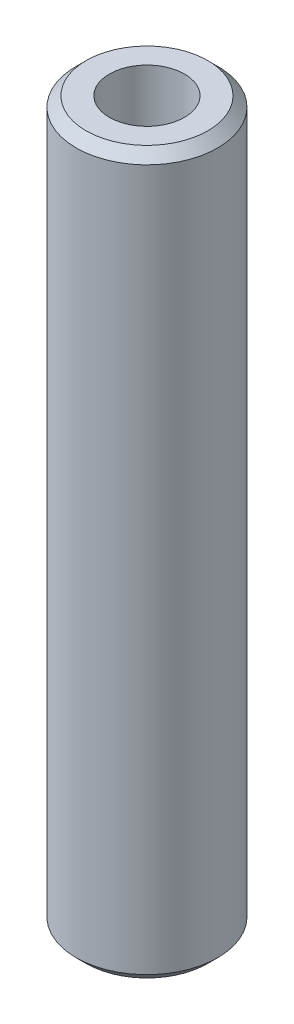
ISO-10303-21;
HEADER;
FILE_DESCRIPTION(('STEP AP214'),'2;1');
FILE_NAME('part.step','',(''),(''),'','','');
FILE_SCHEMA(('AUTOMOTIVE_DESIGN { 1 0 10303 214 1 1 1 1 }'));
ENDSEC;
DATA;
#1=APPLICATION_CONTEXT('core data for automotive mechanical design processes');
#2=APPLICATION_PROTOCOL_DEFINITION('international standard','automotive_design',2000,#1);
#3=PRODUCT_CONTEXT('',#1,'mechanical');
#4=PRODUCT('Part','Part','',(#3));
#5=PRODUCT_RELATED_PRODUCT_CATEGORY('part','',(#4));
#6=PRODUCT_DEFINITION_FORMATION('','',#4);
#7=PRODUCT_DEFINITION_CONTEXT('part definition',#1,'design');
#8=PRODUCT_DEFINITION('design','',#6,#7);
#9=PRODUCT_DEFINITION_SHAPE('','',#8);
#10=(LENGTH_UNIT() NAMED_UNIT(*) SI_UNIT(.MILLI.,.METRE.));
#11=(NAMED_UNIT(*) PLANE_ANGLE_UNIT() SI_UNIT($,.RADIAN.));
#12=(NAMED_UNIT(*) SI_UNIT($,.STERADIAN.) SOLID_ANGLE_UNIT());
#13=UNCERTAINTY_MEASURE_WITH_UNIT(LENGTH_MEASURE(1.E-05),#10,'distance_accuracy_value','');
#14=(GEOMETRIC_REPRESENTATION_CONTEXT(3) GLOBAL_UNCERTAINTY_ASSIGNED_CONTEXT((#13)) GLOBAL_UNIT_ASSIGNED_CONTEXT((#10,
#11,#12)) REPRESENTATION_CONTEXT('',''));
#15=CARTESIAN_POINT('',(0.,0.,0.));
#16=DIRECTION('',(0.,0.,1.));
#17=DIRECTION('',(1.,0.,0.));
#18=AXIS2_PLACEMENT_3D('',#15,#16,#17);
#19=CARTESIAN_POINT('',(0.,178.356466410994,0.));
#20=DIRECTION('',(0.,-1.,0.));
#21=DIRECTION('',(0.,0.,-1.));
#22=AXIS2_PLACEMENT_3D('',#19,#20,#21);
#23=CYLINDRICAL_SURFACE('',#22,17.5);
#24=CARTESIAN_POINT('',(0.,175.909775567955,0.));
#25=DIRECTION('',(0.,1.,0.));
#26=DIRECTION('',(0.,0.,1.));
#27=AXIS2_PLACEMENT_3D('',#24,#25,#26);
#28=CIRCLE('',#27,17.5);
#29=CARTESIAN_POINT('',(0.,175.909775567955,17.5));
#30=VERTEX_POINT('',#29);
#31=EDGE_CURVE('E50',#30,#30,#28,.F.);
#32=ORIENTED_EDGE('',*,*,#31,.T.);
#33=EDGE_LOOP('',(#32));
#34=FACE_BOUND('',#33,.T.);
#35=CARTESIAN_POINT('',(0.,2.44669084303856,0.));
#36=DIRECTION('',(0.,1.,0.));
#37=DIRECTION('',(0.,0.,1.));
#38=AXIS2_PLACEMENT_3D('',#35,#36,#37);
#39=CIRCLE('',#38,17.5);
#40=CARTESIAN_POINT('',(0.,2.44669084303856,17.5));
#41=VERTEX_POINT('',#40);
#42=EDGE_CURVE('E51',#41,#41,#39,.T.);
#43=ORIENTED_EDGE('',*,*,#42,.T.);
#44=EDGE_LOOP('',(#43));
#45=FACE_BOUND('',#44,.T.);
#46=ADVANCED_FACE('F39',(#34,#45),#23,.T.);
#47=CARTESIAN_POINT('',(0.,178.356466410994,0.));
#48=DIRECTION('',(0.,1.,0.));
#49=DIRECTION('',(0.,0.,1.));
#50=AXIS2_PLACEMENT_3D('',#47,#48,#49);
#51=PLANE('',#50);
#52=CARTESIAN_POINT('',(0.,178.356466410994,0.));
#53=DIRECTION('',(0.,1.,0.));
#54=DIRECTION('',(0.,0.,1.));
#55=AXIS2_PLACEMENT_3D('',#52,#53,#54);
#56=CIRCLE('',#55,15.0533091569614);
#57=CARTESIAN_POINT('',(0.,178.356466410994,15.0533091569614));
#58=VERTEX_POINT('',#57);
#59=EDGE_CURVE('E54',#58,#58,#56,.T.);
#60=ORIENTED_EDGE('',*,*,#59,.T.);
#61=EDGE_LOOP('',(#60));
#62=FACE_BOUND('',#61,.T.);
#63=CARTESIAN_POINT('',(0.,178.356466410994,0.));
#64=DIRECTION('',(0.,1.,0.));
#65=DIRECTION('',(0.,0.,1.));
#66=AXIS2_PLACEMENT_3D('',#63,#64,#65);
#67=CIRCLE('',#66,9.29110883038514);
#68=CARTESIAN_POINT('',(0.,178.356466410994,9.29110883038514));
#69=VERTEX_POINT('',#68);
#70=EDGE_CURVE('E58',#69,#69,#67,.T.);
#71=ORIENTED_EDGE('',*,*,#70,.F.);
#72=EDGE_LOOP('',(#71));
#73=FACE_BOUND('',#72,.T.);
#74=ADVANCED_FACE('F69',(#62,#73),#51,.T.);
#75=CARTESIAN_POINT('',(0.,0.,0.));
#76=DIRECTION('',(0.,1.,0.));
#77=DIRECTION('',(0.,0.,1.));
#78=AXIS2_PLACEMENT_3D('',#75,#76,#77);
#79=PLANE('',#78);
#80=CARTESIAN_POINT('',(0.,0.,0.));
#81=DIRECTION('',(0.,1.,0.));
#82=DIRECTION('',(0.,0.,1.));
#83=AXIS2_PLACEMENT_3D('',#80,#81,#82);
#84=CIRCLE('',#83,15.0533091569614);
#85=CARTESIAN_POINT('',(0.,0.,15.0533091569614));
#86=VERTEX_POINT('',#85);
#87=EDGE_CURVE('E10',#86,#86,#84,.F.);
#88=ORIENTED_EDGE('',*,*,#87,.T.);
#89=EDGE_LOOP('',(#88));
#90=FACE_BOUND('',#89,.T.);
#91=CARTESIAN_POINT('',(0.,0.,0.));
#92=DIRECTION('',(0.,1.,0.));
#93=DIRECTION('',(0.,0.,1.));
#94=AXIS2_PLACEMENT_3D('',#91,#92,#93);
#95=CIRCLE('',#94,9.29110883038514);
#96=CARTESIAN_POINT('',(0.,0.,9.29110883038514));
#97=VERTEX_POINT('',#96);
#98=EDGE_CURVE('E63',#97,#97,#95,.T.);
#99=ORIENTED_EDGE('',*,*,#98,.T.);
#100=EDGE_LOOP('',(#99));
#101=FACE_BOUND('',#100,.T.);
#102=ADVANCED_FACE('F75',(#90,#101),#79,.F.);
#103=CARTESIAN_POINT('',(0.,178.356466410994,0.));
#104=DIRECTION('',(0.,-1.,0.));
#105=DIRECTION('',(0.,0.,-1.));
#106=AXIS2_PLACEMENT_3D('',#103,#104,#105);
#107=CYLINDRICAL_SURFACE('',#106,9.29110883038514);
#108=ORIENTED_EDGE('',*,*,#70,.T.);
#109=EDGE_LOOP('',(#108));
#110=FACE_BOUND('',#109,.T.);
#111=ORIENTED_EDGE('',*,*,#98,.F.);
#112=EDGE_LOOP('',(#111));
#113=FACE_BOUND('',#112,.T.);
#114=ADVANCED_FACE('F70',(#110,#113),#107,.F.);
#115=CARTESIAN_POINT('',(0.,178.356466410994,0.));
#116=DIRECTION('',(0.,-1.,0.));
#117=DIRECTION('',(0.,0.,-1.));
#118=AXIS2_PLACEMENT_3D('',#115,#116,#117);
#119=CONICAL_SURFACE('',#118,15.0533091569614,0.785398163397446);
#120=ORIENTED_EDGE('',*,*,#31,.F.);
#121=EDGE_LOOP('',(#120));
#122=FACE_BOUND('',#121,.T.);
#123=ORIENTED_EDGE('',*,*,#59,.F.);
#124=EDGE_LOOP('',(#123));
#125=FACE_BOUND('',#124,.T.);
#126=ADVANCED_FACE('F81',(#122,#125),#119,.T.);
#127=CARTESIAN_POINT('',(0.,2.44669084303856,0.));
#128=DIRECTION('',(0.,1.,0.));
#129=DIRECTION('',(0.,0.,1.));
#130=AXIS2_PLACEMENT_3D('',#127,#128,#129);
#131=CONICAL_SURFACE('',#130,17.5,0.785398163397449);
#132=ORIENTED_EDGE('',*,*,#87,.F.);
#133=EDGE_LOOP('',(#132));
#134=FACE_BOUND('',#133,.T.);
#135=ORIENTED_EDGE('',*,*,#42,.F.);
#136=EDGE_LOOP('',(#135));
#137=FACE_BOUND('',#136,.T.);
#138=ADVANCED_FACE('F45',(#134,#137),#131,.T.);
#139=CLOSED_SHELL('',(#46,#74,#102,#114,#126,#138));
#140=MANIFOLD_SOLID_BREP('B2',#139);
#141=ADVANCED_BREP_SHAPE_REPRESENTATION('',(#18,#140),#14);
#142=SHAPE_DEFINITION_REPRESENTATION(#9,#141);
ENDSEC;
END-ISO-10303-21;
